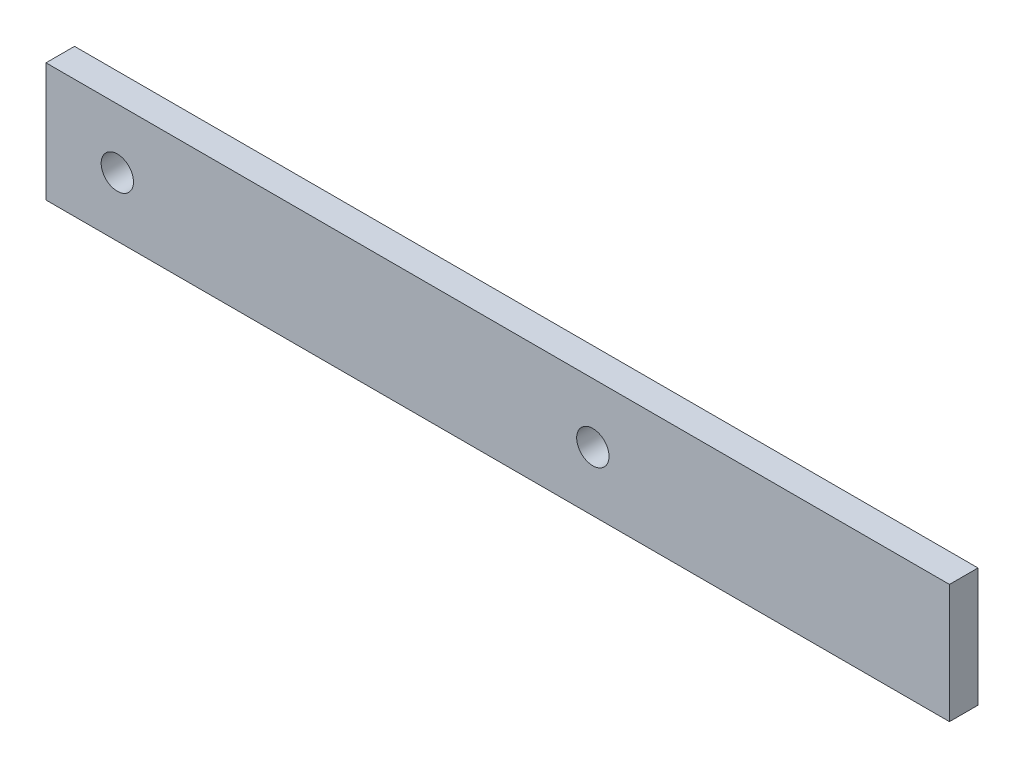
ISO-10303-21;
HEADER;
FILE_DESCRIPTION(('STEP AP214'),'2;1');
FILE_NAME('part.step','',(''),(''),'','','');
FILE_SCHEMA(('AUTOMOTIVE_DESIGN { 1 0 10303 214 1 1 1 1 }'));
ENDSEC;
DATA;
#1=APPLICATION_CONTEXT('core data for automotive mechanical design processes');
#2=APPLICATION_PROTOCOL_DEFINITION('international standard','automotive_design',2000,#1);
#3=PRODUCT_CONTEXT('',#1,'mechanical');
#4=PRODUCT('Part','Part','',(#3));
#5=PRODUCT_RELATED_PRODUCT_CATEGORY('part','',(#4));
#6=PRODUCT_DEFINITION_FORMATION('','',#4);
#7=PRODUCT_DEFINITION_CONTEXT('part definition',#1,'design');
#8=PRODUCT_DEFINITION('design','',#6,#7);
#9=PRODUCT_DEFINITION_SHAPE('','',#8);
#10=(LENGTH_UNIT() NAMED_UNIT(*) SI_UNIT(.MILLI.,.METRE.));
#11=(NAMED_UNIT(*) PLANE_ANGLE_UNIT() SI_UNIT($,.RADIAN.));
#12=(NAMED_UNIT(*) SI_UNIT($,.STERADIAN.) SOLID_ANGLE_UNIT());
#13=UNCERTAINTY_MEASURE_WITH_UNIT(LENGTH_MEASURE(1.E-05),#10,'distance_accuracy_value','');
#14=(GEOMETRIC_REPRESENTATION_CONTEXT(3) GLOBAL_UNCERTAINTY_ASSIGNED_CONTEXT((#13)) GLOBAL_UNIT_ASSIGNED_CONTEXT((#10,
#11,#12)) REPRESENTATION_CONTEXT('',''));
#15=CARTESIAN_POINT('',(0.,0.,0.));
#16=DIRECTION('',(0.,0.,1.));
#17=DIRECTION('',(1.,0.,0.));
#18=AXIS2_PLACEMENT_3D('',#15,#16,#17);
#19=CARTESIAN_POINT('',(-115.,-12.5,6.));
#20=DIRECTION('',(0.,0.,-1.));
#21=DIRECTION('',(-1.,0.,0.));
#22=AXIS2_PLACEMENT_3D('',#19,#20,#21);
#23=PLANE('',#22);
#24=CARTESIAN_POINT('',(0.,0.,6.));
#25=DIRECTION('',(0.,0.,1.));
#26=DIRECTION('',(1.,0.,0.));
#27=AXIS2_PLACEMENT_3D('',#24,#25,#26);
#28=CIRCLE('',#27,3.4);
#29=CARTESIAN_POINT('',(3.4,0.,6.));
#30=VERTEX_POINT('',#29);
#31=EDGE_CURVE('E114',#30,#30,#28,.T.);
#32=ORIENTED_EDGE('',*,*,#31,.F.);
#33=EDGE_LOOP('',(#32));
#34=FACE_BOUND('',#33,.T.);
#35=DIRECTION('',(0.,1.,0.));
#36=VECTOR('',#35,1.);
#37=CARTESIAN_POINT('',(-115.,-12.5,6.));
#38=LINE('',#37,#36);
#39=CARTESIAN_POINT('',(-115.,-12.5,6.));
#40=VERTEX_POINT('',#39);
#41=CARTESIAN_POINT('',(-115.,12.5,6.));
#42=VERTEX_POINT('',#41);
#43=EDGE_CURVE('E102',#40,#42,#38,.T.);
#44=ORIENTED_EDGE('',*,*,#43,.F.);
#45=DIRECTION('',(1.,0.,0.));
#46=VECTOR('',#45,1.);
#47=CARTESIAN_POINT('',(-115.,-12.5,6.));
#48=LINE('',#47,#46);
#49=CARTESIAN_POINT('',(75.,-12.5,6.));
#50=VERTEX_POINT('',#49);
#51=EDGE_CURVE('E105',#40,#50,#48,.T.);
#52=ORIENTED_EDGE('',*,*,#51,.T.);
#53=DIRECTION('',(0.,-1.,0.));
#54=VECTOR('',#53,1.);
#55=CARTESIAN_POINT('',(75.,12.5,6.));
#56=LINE('',#55,#54);
#57=CARTESIAN_POINT('',(75.,12.5,6.));
#58=VERTEX_POINT('',#57);
#59=EDGE_CURVE('E95',#58,#50,#56,.T.);
#60=ORIENTED_EDGE('',*,*,#59,.F.);
#61=DIRECTION('',(-1.,0.,0.));
#62=VECTOR('',#61,1.);
#63=CARTESIAN_POINT('',(75.,12.5,6.));
#64=LINE('',#63,#62);
#65=EDGE_CURVE('E90',#58,#42,#64,.T.);
#66=ORIENTED_EDGE('',*,*,#65,.T.);
#67=EDGE_LOOP('',(#44,#52,#60,#66));
#68=FACE_BOUND('',#67,.T.);
#69=CARTESIAN_POINT('',(-100.,0.,6.));
#70=DIRECTION('',(0.,0.,1.));
#71=DIRECTION('',(1.,0.,0.));
#72=AXIS2_PLACEMENT_3D('',#69,#70,#71);
#73=CIRCLE('',#72,3.4);
#74=CARTESIAN_POINT('',(-96.6,0.,6.));
#75=VERTEX_POINT('',#74);
#76=EDGE_CURVE('E123',#75,#75,#73,.T.);
#77=ORIENTED_EDGE('',*,*,#76,.F.);
#78=EDGE_LOOP('',(#77));
#79=FACE_BOUND('',#78,.T.);
#80=ADVANCED_FACE('F45',(#34,#68,#79),#23,.F.);
#81=CARTESIAN_POINT('',(-115.,-12.5,0.));
#82=DIRECTION('',(0.,0.,-1.));
#83=DIRECTION('',(-1.,0.,0.));
#84=AXIS2_PLACEMENT_3D('',#81,#82,#83);
#85=PLANE('',#84);
#86=CARTESIAN_POINT('',(0.,0.,0.));
#87=DIRECTION('',(0.,0.,1.));
#88=DIRECTION('',(1.,0.,0.));
#89=AXIS2_PLACEMENT_3D('',#86,#87,#88);
#90=CIRCLE('',#89,3.4);
#91=CARTESIAN_POINT('',(3.4,0.,0.));
#92=VERTEX_POINT('',#91);
#93=EDGE_CURVE('E120',#92,#92,#90,.T.);
#94=ORIENTED_EDGE('',*,*,#93,.T.);
#95=EDGE_LOOP('',(#94));
#96=FACE_BOUND('',#95,.T.);
#97=DIRECTION('',(0.,1.,0.));
#98=VECTOR('',#97,1.);
#99=CARTESIAN_POINT('',(-115.,-12.5,0.));
#100=LINE('',#99,#98);
#101=CARTESIAN_POINT('',(-115.,-12.5,0.));
#102=VERTEX_POINT('',#101);
#103=CARTESIAN_POINT('',(-115.,12.5,0.));
#104=VERTEX_POINT('',#103);
#105=EDGE_CURVE('E110',#102,#104,#100,.T.);
#106=ORIENTED_EDGE('',*,*,#105,.T.);
#107=DIRECTION('',(-1.,0.,0.));
#108=VECTOR('',#107,1.);
#109=CARTESIAN_POINT('',(75.,12.5,0.));
#110=LINE('',#109,#108);
#111=CARTESIAN_POINT('',(75.,12.5,0.));
#112=VERTEX_POINT('',#111);
#113=EDGE_CURVE('E113',#112,#104,#110,.T.);
#114=ORIENTED_EDGE('',*,*,#113,.F.);
#115=DIRECTION('',(0.,-1.,0.));
#116=VECTOR('',#115,1.);
#117=CARTESIAN_POINT('',(75.,12.5,0.));
#118=LINE('',#117,#116);
#119=CARTESIAN_POINT('',(75.,-12.5,0.));
#120=VERTEX_POINT('',#119);
#121=EDGE_CURVE('E97',#112,#120,#118,.T.);
#122=ORIENTED_EDGE('',*,*,#121,.T.);
#123=DIRECTION('',(1.,0.,0.));
#124=VECTOR('',#123,1.);
#125=CARTESIAN_POINT('',(-115.,-12.5,0.));
#126=LINE('',#125,#124);
#127=EDGE_CURVE('E117',#102,#120,#126,.T.);
#128=ORIENTED_EDGE('',*,*,#127,.F.);
#129=EDGE_LOOP('',(#106,#114,#122,#128));
#130=FACE_BOUND('',#129,.T.);
#131=CARTESIAN_POINT('',(-100.,0.,0.));
#132=DIRECTION('',(0.,0.,1.));
#133=DIRECTION('',(1.,0.,0.));
#134=AXIS2_PLACEMENT_3D('',#131,#132,#133);
#135=CIRCLE('',#134,3.4);
#136=CARTESIAN_POINT('',(-96.6,0.,0.));
#137=VERTEX_POINT('',#136);
#138=EDGE_CURVE('E126',#137,#137,#135,.T.);
#139=ORIENTED_EDGE('',*,*,#138,.T.);
#140=EDGE_LOOP('',(#139));
#141=FACE_BOUND('',#140,.T.);
#142=ADVANCED_FACE('F135',(#96,#130,#141),#85,.T.);
#143=CARTESIAN_POINT('',(-115.,-12.5,6.));
#144=DIRECTION('',(-1.,0.,0.));
#145=DIRECTION('',(0.,0.,1.));
#146=AXIS2_PLACEMENT_3D('',#143,#144,#145);
#147=PLANE('',#146);
#148=ORIENTED_EDGE('',*,*,#105,.F.);
#149=DIRECTION('',(0.,0.,-1.));
#150=VECTOR('',#149,1.);
#151=CARTESIAN_POINT('',(-115.,-12.5,6.));
#152=LINE('',#151,#150);
#153=EDGE_CURVE('E11',#40,#102,#152,.T.);
#154=ORIENTED_EDGE('',*,*,#153,.F.);
#155=ORIENTED_EDGE('',*,*,#43,.T.);
#156=DIRECTION('',(0.,0.,-1.));
#157=VECTOR('',#156,1.);
#158=CARTESIAN_POINT('',(-115.,12.5,6.));
#159=LINE('',#158,#157);
#160=EDGE_CURVE('E49',#42,#104,#159,.T.);
#161=ORIENTED_EDGE('',*,*,#160,.T.);
#162=EDGE_LOOP('',(#148,#154,#155,#161));
#163=FACE_BOUND('',#162,.T.);
#164=ADVANCED_FACE('F47',(#163),#147,.T.);
#165=CARTESIAN_POINT('',(-115.,-12.5,6.));
#166=DIRECTION('',(0.,1.,0.));
#167=DIRECTION('',(-1.,0.,0.));
#168=AXIS2_PLACEMENT_3D('',#165,#166,#167);
#169=PLANE('',#168);
#170=ORIENTED_EDGE('',*,*,#127,.T.);
#171=DIRECTION('',(0.,0.,-1.));
#172=VECTOR('',#171,1.);
#173=CARTESIAN_POINT('',(75.,-12.5,6.));
#174=LINE('',#173,#172);
#175=EDGE_CURVE('E55',#50,#120,#174,.T.);
#176=ORIENTED_EDGE('',*,*,#175,.F.);
#177=ORIENTED_EDGE('',*,*,#51,.F.);
#178=ORIENTED_EDGE('',*,*,#153,.T.);
#179=EDGE_LOOP('',(#170,#176,#177,#178));
#180=FACE_BOUND('',#179,.T.);
#181=ADVANCED_FACE('F148',(#180),#169,.F.);
#182=CARTESIAN_POINT('',(75.,12.5,6.));
#183=DIRECTION('',(1.,0.,0.));
#184=DIRECTION('',(0.,0.,-1.));
#185=AXIS2_PLACEMENT_3D('',#182,#183,#184);
#186=PLANE('',#185);
#187=ORIENTED_EDGE('',*,*,#121,.F.);
#188=DIRECTION('',(0.,0.,-1.));
#189=VECTOR('',#188,1.);
#190=CARTESIAN_POINT('',(75.,12.5,6.));
#191=LINE('',#190,#189);
#192=EDGE_CURVE('E93',#58,#112,#191,.T.);
#193=ORIENTED_EDGE('',*,*,#192,.F.);
#194=ORIENTED_EDGE('',*,*,#59,.T.);
#195=ORIENTED_EDGE('',*,*,#175,.T.);
#196=EDGE_LOOP('',(#187,#193,#194,#195));
#197=FACE_BOUND('',#196,.T.);
#198=ADVANCED_FACE('F94',(#197),#186,.T.);
#199=CARTESIAN_POINT('',(75.,12.5,6.));
#200=DIRECTION('',(0.,-1.,0.));
#201=DIRECTION('',(1.,0.,0.));
#202=AXIS2_PLACEMENT_3D('',#199,#200,#201);
#203=PLANE('',#202);
#204=ORIENTED_EDGE('',*,*,#113,.T.);
#205=ORIENTED_EDGE('',*,*,#160,.F.);
#206=ORIENTED_EDGE('',*,*,#65,.F.);
#207=ORIENTED_EDGE('',*,*,#192,.T.);
#208=EDGE_LOOP('',(#204,#205,#206,#207));
#209=FACE_BOUND('',#208,.T.);
#210=ADVANCED_FACE('F101',(#209),#203,.F.);
#211=CARTESIAN_POINT('',(0.,0.,6.));
#212=DIRECTION('',(0.,0.,-1.));
#213=DIRECTION('',(-1.,0.,0.));
#214=AXIS2_PLACEMENT_3D('',#211,#212,#213);
#215=CYLINDRICAL_SURFACE('',#214,3.4);
#216=ORIENTED_EDGE('',*,*,#31,.T.);
#217=EDGE_LOOP('',(#216));
#218=FACE_BOUND('',#217,.T.);
#219=ORIENTED_EDGE('',*,*,#93,.F.);
#220=EDGE_LOOP('',(#219));
#221=FACE_BOUND('',#220,.T.);
#222=ADVANCED_FACE('F145',(#218,#221),#215,.F.);
#223=CARTESIAN_POINT('',(-100.,0.,6.));
#224=DIRECTION('',(0.,0.,-1.));
#225=DIRECTION('',(-1.,0.,0.));
#226=AXIS2_PLACEMENT_3D('',#223,#224,#225);
#227=CYLINDRICAL_SURFACE('',#226,3.4);
#228=ORIENTED_EDGE('',*,*,#76,.T.);
#229=EDGE_LOOP('',(#228));
#230=FACE_BOUND('',#229,.T.);
#231=ORIENTED_EDGE('',*,*,#138,.F.);
#232=EDGE_LOOP('',(#231));
#233=FACE_BOUND('',#232,.T.);
#234=ADVANCED_FACE('F132',(#230,#233),#227,.F.);
#235=CLOSED_SHELL('',(#80,#142,#164,#181,#198,#210,#222,#234));
#236=MANIFOLD_SOLID_BREP('B2',#235);
#237=ADVANCED_BREP_SHAPE_REPRESENTATION('',(#18,#236),#14);
#238=SHAPE_DEFINITION_REPRESENTATION(#9,#237);
ENDSEC;
END-ISO-10303-21;
